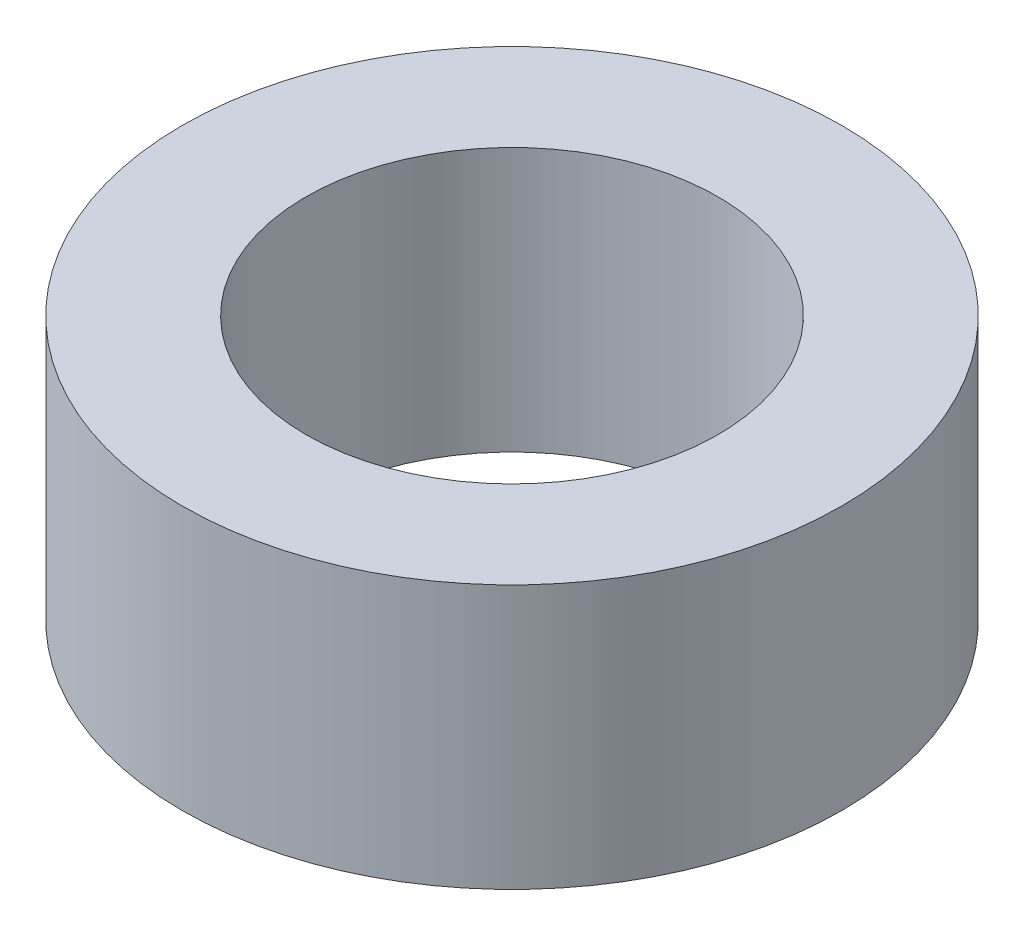
ISO-10303-21;
HEADER;
FILE_DESCRIPTION(('STEP AP214'),'2;1');
FILE_NAME('part.step','',(''),(''),'','','');
FILE_SCHEMA(('AUTOMOTIVE_DESIGN { 1 0 10303 214 1 1 1 1 }'));
ENDSEC;
DATA;
#1=APPLICATION_CONTEXT('core data for automotive mechanical design processes');
#2=APPLICATION_PROTOCOL_DEFINITION('international standard','automotive_design',2000,#1);
#3=PRODUCT_CONTEXT('',#1,'mechanical');
#4=PRODUCT('Part','Part','',(#3));
#5=PRODUCT_RELATED_PRODUCT_CATEGORY('part','',(#4));
#6=PRODUCT_DEFINITION_FORMATION('','',#4);
#7=PRODUCT_DEFINITION_CONTEXT('part definition',#1,'design');
#8=PRODUCT_DEFINITION('design','',#6,#7);
#9=PRODUCT_DEFINITION_SHAPE('','',#8);
#10=(LENGTH_UNIT() NAMED_UNIT(*) SI_UNIT(.MILLI.,.METRE.));
#11=(NAMED_UNIT(*) PLANE_ANGLE_UNIT() SI_UNIT($,.RADIAN.));
#12=(NAMED_UNIT(*) SI_UNIT($,.STERADIAN.) SOLID_ANGLE_UNIT());
#13=UNCERTAINTY_MEASURE_WITH_UNIT(LENGTH_MEASURE(1.E-05),#10,'distance_accuracy_value','');
#14=(GEOMETRIC_REPRESENTATION_CONTEXT(3) GLOBAL_UNCERTAINTY_ASSIGNED_CONTEXT((#13)) GLOBAL_UNIT_ASSIGNED_CONTEXT((#10,
#11,#12)) REPRESENTATION_CONTEXT('',''));
#15=CARTESIAN_POINT('',(0.,0.,0.));
#16=DIRECTION('',(0.,0.,1.));
#17=DIRECTION('',(1.,0.,0.));
#18=AXIS2_PLACEMENT_3D('',#15,#16,#17);
#19=CARTESIAN_POINT('',(0.,16.,0.));
#20=DIRECTION('',(0.,-1.,0.));
#21=DIRECTION('',(0.,0.,-1.));
#22=AXIS2_PLACEMENT_3D('',#19,#20,#21);
#23=CYLINDRICAL_SURFACE('',#22,20.);
#24=CARTESIAN_POINT('',(0.,16.,0.));
#25=DIRECTION('',(0.,1.,0.));
#26=DIRECTION('',(0.,0.,1.));
#27=AXIS2_PLACEMENT_3D('',#24,#25,#26);
#28=CIRCLE('',#27,20.);
#29=CARTESIAN_POINT('',(0.,16.,20.));
#30=VERTEX_POINT('',#29);
#31=EDGE_CURVE('E10',#30,#30,#28,.T.);
#32=ORIENTED_EDGE('',*,*,#31,.F.);
#33=EDGE_LOOP('',(#32));
#34=FACE_BOUND('',#33,.T.);
#35=CARTESIAN_POINT('',(0.,0.,0.));
#36=DIRECTION('',(0.,1.,0.));
#37=DIRECTION('',(0.,0.,1.));
#38=AXIS2_PLACEMENT_3D('',#35,#36,#37);
#39=CIRCLE('',#38,20.);
#40=CARTESIAN_POINT('',(0.,0.,20.));
#41=VERTEX_POINT('',#40);
#42=EDGE_CURVE('E37',#41,#41,#39,.T.);
#43=ORIENTED_EDGE('',*,*,#42,.T.);
#44=EDGE_LOOP('',(#43));
#45=FACE_BOUND('',#44,.T.);
#46=ADVANCED_FACE('F40',(#34,#45),#23,.T.);
#47=CARTESIAN_POINT('',(0.,16.,0.));
#48=DIRECTION('',(0.,1.,0.));
#49=DIRECTION('',(0.,0.,1.));
#50=AXIS2_PLACEMENT_3D('',#47,#48,#49);
#51=PLANE('',#50);
#52=CARTESIAN_POINT('',(0.,16.,0.));
#53=DIRECTION('',(0.,1.,0.));
#54=DIRECTION('',(0.,0.,1.));
#55=AXIS2_PLACEMENT_3D('',#52,#53,#54);
#56=CIRCLE('',#55,12.5);
#57=CARTESIAN_POINT('',(0.,16.,12.5));
#58=VERTEX_POINT('',#57);
#59=EDGE_CURVE('E50',#58,#58,#56,.T.);
#60=ORIENTED_EDGE('',*,*,#59,.F.);
#61=EDGE_LOOP('',(#60));
#62=FACE_BOUND('',#61,.T.);
#63=ORIENTED_EDGE('',*,*,#31,.T.);
#64=EDGE_LOOP('',(#63));
#65=FACE_BOUND('',#64,.T.);
#66=ADVANCED_FACE('F59',(#62,#65),#51,.T.);
#67=CARTESIAN_POINT('',(0.,0.,0.));
#68=DIRECTION('',(0.,1.,0.));
#69=DIRECTION('',(0.,0.,1.));
#70=AXIS2_PLACEMENT_3D('',#67,#68,#69);
#71=PLANE('',#70);
#72=CARTESIAN_POINT('',(0.,0.,0.));
#73=DIRECTION('',(0.,1.,0.));
#74=DIRECTION('',(0.,0.,1.));
#75=AXIS2_PLACEMENT_3D('',#72,#73,#74);
#76=CIRCLE('',#75,12.5);
#77=CARTESIAN_POINT('',(0.,0.,12.5));
#78=VERTEX_POINT('',#77);
#79=EDGE_CURVE('E47',#78,#78,#76,.T.);
#80=ORIENTED_EDGE('',*,*,#79,.T.);
#81=EDGE_LOOP('',(#80));
#82=FACE_BOUND('',#81,.T.);
#83=ORIENTED_EDGE('',*,*,#42,.F.);
#84=EDGE_LOOP('',(#83));
#85=FACE_BOUND('',#84,.T.);
#86=ADVANCED_FACE('F58',(#82,#85),#71,.F.);
#87=CARTESIAN_POINT('',(0.,16.,0.));
#88=DIRECTION('',(0.,-1.,0.));
#89=DIRECTION('',(0.,0.,-1.));
#90=AXIS2_PLACEMENT_3D('',#87,#88,#89);
#91=CYLINDRICAL_SURFACE('',#90,12.5);
#92=ORIENTED_EDGE('',*,*,#59,.T.);
#93=EDGE_LOOP('',(#92));
#94=FACE_BOUND('',#93,.T.);
#95=ORIENTED_EDGE('',*,*,#79,.F.);
#96=EDGE_LOOP('',(#95));
#97=FACE_BOUND('',#96,.T.);
#98=ADVANCED_FACE('F54',(#94,#97),#91,.F.);
#99=CLOSED_SHELL('',(#46,#66,#86,#98));
#100=MANIFOLD_SOLID_BREP('B2',#99);
#101=ADVANCED_BREP_SHAPE_REPRESENTATION('',(#18,#100),#14);
#102=SHAPE_DEFINITION_REPRESENTATION(#9,#101);
ENDSEC;
END-ISO-10303-21;
